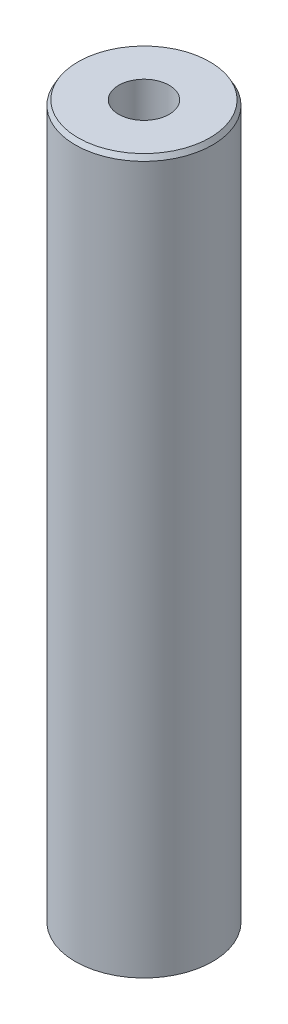
ISO-10303-21;
HEADER;
FILE_DESCRIPTION(('STEP AP214'),'2;1');
FILE_NAME('part.step','',(''),(''),'','','');
FILE_SCHEMA(('AUTOMOTIVE_DESIGN { 1 0 10303 214 1 1 1 1 }'));
ENDSEC;
DATA;
#1=APPLICATION_CONTEXT('core data for automotive mechanical design processes');
#2=APPLICATION_PROTOCOL_DEFINITION('international standard','automotive_design',2000,#1);
#3=PRODUCT_CONTEXT('',#1,'mechanical');
#4=PRODUCT('Part','Part','',(#3));
#5=PRODUCT_RELATED_PRODUCT_CATEGORY('part','',(#4));
#6=PRODUCT_DEFINITION_FORMATION('','',#4);
#7=PRODUCT_DEFINITION_CONTEXT('part definition',#1,'design');
#8=PRODUCT_DEFINITION('design','',#6,#7);
#9=PRODUCT_DEFINITION_SHAPE('','',#8);
#10=(LENGTH_UNIT() NAMED_UNIT(*) SI_UNIT(.MILLI.,.METRE.));
#11=(NAMED_UNIT(*) PLANE_ANGLE_UNIT() SI_UNIT($,.RADIAN.));
#12=(NAMED_UNIT(*) SI_UNIT($,.STERADIAN.) SOLID_ANGLE_UNIT());
#13=UNCERTAINTY_MEASURE_WITH_UNIT(LENGTH_MEASURE(1.E-05),#10,'distance_accuracy_value','');
#14=(GEOMETRIC_REPRESENTATION_CONTEXT(3) GLOBAL_UNCERTAINTY_ASSIGNED_CONTEXT((#13)) GLOBAL_UNIT_ASSIGNED_CONTEXT((#10,
#11,#12)) REPRESENTATION_CONTEXT('',''));
#15=CARTESIAN_POINT('',(0.,0.,0.));
#16=DIRECTION('',(0.,0.,1.));
#17=DIRECTION('',(1.,0.,0.));
#18=AXIS2_PLACEMENT_3D('',#15,#16,#17);
#19=CARTESIAN_POINT('',(0.,572.582427979009,0.));
#20=DIRECTION('',(0.,-1.,0.));
#21=DIRECTION('',(0.,0.,-1.));
#22=AXIS2_PLACEMENT_3D('',#19,#20,#21);
#23=CYLINDRICAL_SURFACE('',#22,55.);
#24=CARTESIAN_POINT('',(0.,568.7383095942,0.));
#25=DIRECTION('',(0.,1.,0.));
#26=DIRECTION('',(0.,0.,1.));
#27=AXIS2_PLACEMENT_3D('',#24,#25,#26);
#28=CIRCLE('',#27,55.);
#29=CARTESIAN_POINT('',(0.,568.7383095942,55.));
#30=VERTEX_POINT('',#29);
#31=EDGE_CURVE('E50',#30,#30,#28,.F.);
#32=ORIENTED_EDGE('',*,*,#31,.T.);
#33=EDGE_LOOP('',(#32));
#34=FACE_BOUND('',#33,.T.);
#35=CARTESIAN_POINT('',(0.,2.21940278426658,0.));
#36=DIRECTION('',(0.,1.,0.));
#37=DIRECTION('',(0.,0.,1.));
#38=AXIS2_PLACEMENT_3D('',#35,#36,#37);
#39=CIRCLE('',#38,55.);
#40=CARTESIAN_POINT('',(0.,2.21940278426658,55.));
#41=VERTEX_POINT('',#40);
#42=EDGE_CURVE('E51',#41,#41,#39,.T.);
#43=ORIENTED_EDGE('',*,*,#42,.T.);
#44=EDGE_LOOP('',(#43));
#45=FACE_BOUND('',#44,.T.);
#46=ADVANCED_FACE('F39',(#34,#45),#23,.T.);
#47=CARTESIAN_POINT('',(0.,572.582427979009,0.));
#48=DIRECTION('',(0.,1.,0.));
#49=DIRECTION('',(0.,0.,1.));
#50=AXIS2_PLACEMENT_3D('',#47,#48,#49);
#51=PLANE('',#50);
#52=CARTESIAN_POINT('',(0.,572.582427979009,0.));
#53=DIRECTION('',(0.,1.,0.));
#54=DIRECTION('',(0.,0.,1.));
#55=AXIS2_PLACEMENT_3D('',#52,#53,#54);
#56=CIRCLE('',#55,52.7805972157335);
#57=CARTESIAN_POINT('',(0.,572.582427979009,52.7805972157335));
#58=VERTEX_POINT('',#57);
#59=EDGE_CURVE('E54',#58,#58,#56,.T.);
#60=ORIENTED_EDGE('',*,*,#59,.T.);
#61=EDGE_LOOP('',(#60));
#62=FACE_BOUND('',#61,.T.);
#63=CARTESIAN_POINT('',(0.,572.582427979009,0.));
#64=DIRECTION('',(0.,1.,0.));
#65=DIRECTION('',(0.,0.,1.));
#66=AXIS2_PLACEMENT_3D('',#63,#64,#65);
#67=CIRCLE('',#66,20.2277326993481);
#68=CARTESIAN_POINT('',(0.,572.582427979009,20.2277326993481));
#69=VERTEX_POINT('',#68);
#70=EDGE_CURVE('E58',#69,#69,#67,.T.);
#71=ORIENTED_EDGE('',*,*,#70,.F.);
#72=EDGE_LOOP('',(#71));
#73=FACE_BOUND('',#72,.T.);
#74=ADVANCED_FACE('F69',(#62,#73),#51,.T.);
#75=CARTESIAN_POINT('',(0.,0.,0.));
#76=DIRECTION('',(0.,1.,0.));
#77=DIRECTION('',(0.,0.,1.));
#78=AXIS2_PLACEMENT_3D('',#75,#76,#77);
#79=PLANE('',#78);
#80=CARTESIAN_POINT('',(0.,0.,0.));
#81=DIRECTION('',(0.,1.,0.));
#82=DIRECTION('',(0.,0.,1.));
#83=AXIS2_PLACEMENT_3D('',#80,#81,#82);
#84=CIRCLE('',#83,51.1558816151905);
#85=CARTESIAN_POINT('',(0.,0.,51.1558816151905));
#86=VERTEX_POINT('',#85);
#87=EDGE_CURVE('E10',#86,#86,#84,.F.);
#88=ORIENTED_EDGE('',*,*,#87,.T.);
#89=EDGE_LOOP('',(#88));
#90=FACE_BOUND('',#89,.T.);
#91=CARTESIAN_POINT('',(0.,0.,0.));
#92=DIRECTION('',(0.,1.,0.));
#93=DIRECTION('',(0.,0.,1.));
#94=AXIS2_PLACEMENT_3D('',#91,#92,#93);
#95=CIRCLE('',#94,20.2277326993481);
#96=CARTESIAN_POINT('',(0.,0.,20.2277326993481));
#97=VERTEX_POINT('',#96);
#98=EDGE_CURVE('E63',#97,#97,#95,.T.);
#99=ORIENTED_EDGE('',*,*,#98,.T.);
#100=EDGE_LOOP('',(#99));
#101=FACE_BOUND('',#100,.T.);
#102=ADVANCED_FACE('F75',(#90,#101),#79,.F.);
#103=CARTESIAN_POINT('',(0.,572.582427979009,0.));
#104=DIRECTION('',(0.,-1.,0.));
#105=DIRECTION('',(0.,0.,-1.));
#106=AXIS2_PLACEMENT_3D('',#103,#104,#105);
#107=CYLINDRICAL_SURFACE('',#106,20.2277326993481);
#108=ORIENTED_EDGE('',*,*,#70,.T.);
#109=EDGE_LOOP('',(#108));
#110=FACE_BOUND('',#109,.T.);
#111=ORIENTED_EDGE('',*,*,#98,.F.);
#112=EDGE_LOOP('',(#111));
#113=FACE_BOUND('',#112,.T.);
#114=ADVANCED_FACE('F70',(#110,#113),#107,.F.);
#115=CARTESIAN_POINT('',(0.,572.582427979009,0.));
#116=DIRECTION('',(0.,-1.,0.));
#117=DIRECTION('',(0.,0.,-1.));
#118=AXIS2_PLACEMENT_3D('',#115,#116,#117);
#119=CONICAL_SURFACE('',#118,52.7805972157335,0.523598775598297);
#120=ORIENTED_EDGE('',*,*,#31,.F.);
#121=EDGE_LOOP('',(#120));
#122=FACE_BOUND('',#121,.T.);
#123=ORIENTED_EDGE('',*,*,#59,.F.);
#124=EDGE_LOOP('',(#123));
#125=FACE_BOUND('',#124,.T.);
#126=ADVANCED_FACE('F81',(#122,#125),#119,.T.);
#127=CARTESIAN_POINT('',(0.,2.21940278426658,0.));
#128=DIRECTION('',(0.,1.,0.));
#129=DIRECTION('',(0.,0.,1.));
#130=AXIS2_PLACEMENT_3D('',#127,#128,#129);
#131=CONICAL_SURFACE('',#130,55.,1.0471975511966);
#132=ORIENTED_EDGE('',*,*,#87,.F.);
#133=EDGE_LOOP('',(#132));
#134=FACE_BOUND('',#133,.T.);
#135=ORIENTED_EDGE('',*,*,#42,.F.);
#136=EDGE_LOOP('',(#135));
#137=FACE_BOUND('',#136,.T.);
#138=ADVANCED_FACE('F45',(#134,#137),#131,.T.);
#139=CLOSED_SHELL('',(#46,#74,#102,#114,#126,#138));
#140=MANIFOLD_SOLID_BREP('B2',#139);
#141=ADVANCED_BREP_SHAPE_REPRESENTATION('',(#18,#140),#14);
#142=SHAPE_DEFINITION_REPRESENTATION(#9,#141);
ENDSEC;
END-ISO-10303-21;
